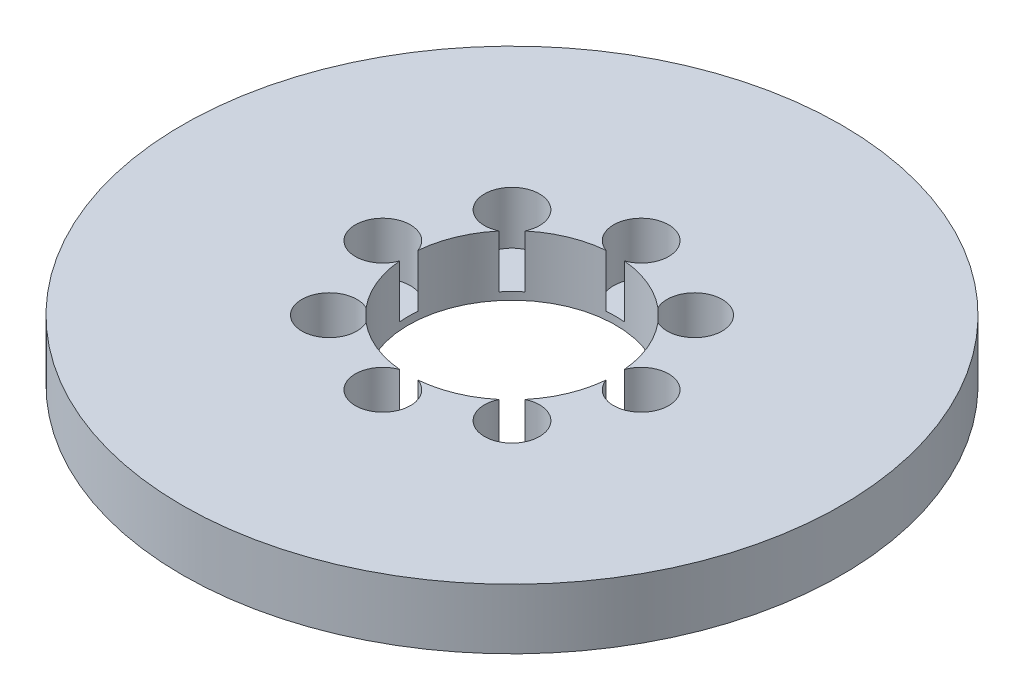
ISO-10303-21;
HEADER;
FILE_DESCRIPTION(('STEP AP214'),'2;1');
FILE_NAME('part.step','',(''),(''),'','','');
FILE_SCHEMA(('AUTOMOTIVE_DESIGN { 1 0 10303 214 1 1 1 1 }'));
ENDSEC;
DATA;
#1=APPLICATION_CONTEXT('core data for automotive mechanical design processes');
#2=APPLICATION_PROTOCOL_DEFINITION('international standard','automotive_design',2000,#1);
#3=PRODUCT_CONTEXT('',#1,'mechanical');
#4=PRODUCT('Part','Part','',(#3));
#5=PRODUCT_RELATED_PRODUCT_CATEGORY('part','',(#4));
#6=PRODUCT_DEFINITION_FORMATION('','',#4);
#7=PRODUCT_DEFINITION_CONTEXT('part definition',#1,'design');
#8=PRODUCT_DEFINITION('design','',#6,#7);
#9=PRODUCT_DEFINITION_SHAPE('','',#8);
#10=(LENGTH_UNIT() NAMED_UNIT(*) SI_UNIT(.MILLI.,.METRE.));
#11=(NAMED_UNIT(*) PLANE_ANGLE_UNIT() SI_UNIT($,.RADIAN.));
#12=(NAMED_UNIT(*) SI_UNIT($,.STERADIAN.) SOLID_ANGLE_UNIT());
#13=UNCERTAINTY_MEASURE_WITH_UNIT(LENGTH_MEASURE(1.E-05),#10,'distance_accuracy_value','');
#14=(GEOMETRIC_REPRESENTATION_CONTEXT(3) GLOBAL_UNCERTAINTY_ASSIGNED_CONTEXT((#13)) GLOBAL_UNIT_ASSIGNED_CONTEXT((#10,
#11,#12)) REPRESENTATION_CONTEXT('',''));
#15=CARTESIAN_POINT('',(0.,0.,0.));
#16=DIRECTION('',(0.,0.,1.));
#17=DIRECTION('',(1.,0.,0.));
#18=AXIS2_PLACEMENT_3D('',#15,#16,#17);
#19=CARTESIAN_POINT('',(0.,16.,0.));
#20=DIRECTION('',(0.,-1.,0.));
#21=DIRECTION('',(0.,0.,-1.));
#22=AXIS2_PLACEMENT_3D('',#19,#20,#21);
#23=CYLINDRICAL_SURFACE('',#22,87.5);
#24=CARTESIAN_POINT('',(0.,16.,0.));
#25=DIRECTION('',(0.,1.,0.));
#26=DIRECTION('',(0.,0.,1.));
#27=AXIS2_PLACEMENT_3D('',#24,#25,#26);
#28=CIRCLE('',#27,87.5);
#29=CARTESIAN_POINT('',(0.,16.,87.5));
#30=VERTEX_POINT('',#29);
#31=EDGE_CURVE('E195',#30,#30,#28,.T.);
#32=ORIENTED_EDGE('',*,*,#31,.F.);
#33=EDGE_LOOP('',(#32));
#34=FACE_BOUND('',#33,.T.);
#35=CARTESIAN_POINT('',(0.,0.,0.));
#36=DIRECTION('',(0.,1.,0.));
#37=DIRECTION('',(0.,0.,1.));
#38=AXIS2_PLACEMENT_3D('',#35,#36,#37);
#39=CIRCLE('',#38,87.5);
#40=CARTESIAN_POINT('',(0.,0.,87.5));
#41=VERTEX_POINT('',#40);
#42=EDGE_CURVE('E179',#41,#41,#39,.T.);
#43=ORIENTED_EDGE('',*,*,#42,.T.);
#44=EDGE_LOOP('',(#43));
#45=FACE_BOUND('',#44,.T.);
#46=ADVANCED_FACE('F39',(#34,#45),#23,.T.);
#47=CARTESIAN_POINT('',(0.,16.,0.));
#48=DIRECTION('',(0.,1.,0.));
#49=DIRECTION('',(0.,0.,1.));
#50=AXIS2_PLACEMENT_3D('',#47,#48,#49);
#51=PLANE('',#50);
#52=CARTESIAN_POINT('',(1.19720164488988E-13,16.,34.2892179193649));
#53=DIRECTION('',(0.,1.,0.));
#54=DIRECTION('',(1.,0.,0.));
#55=AXIS2_PLACEMENT_3D('',#52,#53,#54);
#56=CIRCLE('',#55,7.30778936502692);
#57=CARTESIAN_POINT('',(-2.41898986393209,16.,27.3934022720471));
#58=VERTEX_POINT('',#57);
#59=CARTESIAN_POINT('',(2.41898986393228,16.,27.3934022720471));
#60=VERTEX_POINT('',#59);
#61=EDGE_CURVE('E176',#58,#60,#56,.T.);
#62=ORIENTED_EDGE('',*,*,#61,.F.);
#63=CARTESIAN_POINT('',(0.,16.,0.));
#64=DIRECTION('',(0.,1.,0.));
#65=DIRECTION('',(0.,0.,1.));
#66=AXIS2_PLACEMENT_3D('',#63,#64,#65);
#67=CIRCLE('',#66,27.5);
#68=CARTESIAN_POINT('',(-17.6595763699275,16.,21.0805446427434));
#69=VERTEX_POINT('',#68);
#70=EDGE_CURVE('E166',#69,#58,#67,.T.);
#71=ORIENTED_EDGE('',*,*,#70,.F.);
#72=CARTESIAN_POINT('',(-24.2461385123662,16.,24.2461385123663));
#73=DIRECTION('',(0.,1.,0.));
#74=DIRECTION('',(0.707106781186549,0.,0.707106781186546));
#75=AXIS2_PLACEMENT_3D('',#72,#73,#74);
#76=CIRCLE('',#75,7.30778936502692);
#77=CARTESIAN_POINT('',(-21.0805446427434,16.,17.6595763699275));
#78=VERTEX_POINT('',#77);
#79=EDGE_CURVE('E147',#78,#69,#76,.T.);
#80=ORIENTED_EDGE('',*,*,#79,.F.);
#81=CARTESIAN_POINT('',(-27.3934022720471,16.,2.41898986393219));
#82=VERTEX_POINT('',#81);
#83=EDGE_CURVE('E180',#82,#78,#67,.T.);
#84=ORIENTED_EDGE('',*,*,#83,.F.);
#85=CARTESIAN_POINT('',(-34.2892179193649,16.,0.));
#86=DIRECTION('',(0.,1.,0.));
#87=DIRECTION('',(0.,0.,1.));
#88=AXIS2_PLACEMENT_3D('',#85,#86,#87);
#89=CIRCLE('',#88,7.30778936502692);
#90=CARTESIAN_POINT('',(-27.3934022720471,16.,-2.41898986393219));
#91=VERTEX_POINT('',#90);
#92=EDGE_CURVE('E186',#91,#82,#89,.T.);
#93=ORIENTED_EDGE('',*,*,#92,.F.);
#94=CARTESIAN_POINT('',(-21.0805446427436,16.,-17.6595763699272));
#95=VERTEX_POINT('',#94);
#96=EDGE_CURVE('E182',#95,#91,#67,.T.);
#97=ORIENTED_EDGE('',*,*,#96,.F.);
#98=CARTESIAN_POINT('',(-24.2461385123665,16.,-24.2461385123659));
#99=DIRECTION('',(0.,1.,0.));
#100=DIRECTION('',(-0.707106781186539,0.,0.707106781186556));
#101=AXIS2_PLACEMENT_3D('',#98,#99,#100);
#102=CIRCLE('',#101,7.30778936502692);
#103=CARTESIAN_POINT('',(-17.6595763699277,16.,-21.0805446427432));
#104=VERTEX_POINT('',#103);
#105=EDGE_CURVE('E446',#104,#95,#102,.T.);
#106=ORIENTED_EDGE('',*,*,#105,.F.);
#107=CARTESIAN_POINT('',(-2.41898986393247,16.,-27.393402272047));
#108=VERTEX_POINT('',#107);
#109=EDGE_CURVE('E452',#108,#104,#67,.T.);
#110=ORIENTED_EDGE('',*,*,#109,.F.);
#111=CARTESIAN_POINT('',(-3.59160493466965E-13,16.,-34.2892179193649));
#112=DIRECTION('',(0.,1.,0.));
#113=DIRECTION('',(-1.,0.,0.));
#114=AXIS2_PLACEMENT_3D('',#111,#112,#113);
#115=CIRCLE('',#114,7.30778936502692);
#116=CARTESIAN_POINT('',(2.4189898639319,16.,-27.3934022720471));
#117=VERTEX_POINT('',#116);
#118=EDGE_CURVE('E477',#117,#108,#115,.T.);
#119=ORIENTED_EDGE('',*,*,#118,.F.);
#120=CARTESIAN_POINT('',(17.6595763699273,16.,-21.0805446427436));
#121=VERTEX_POINT('',#120);
#122=EDGE_CURVE('E460',#121,#117,#67,.T.);
#123=ORIENTED_EDGE('',*,*,#122,.F.);
#124=CARTESIAN_POINT('',(24.246138512366,16.,-24.2461385123664));
#125=DIRECTION('',(0.,1.,0.));
#126=DIRECTION('',(-0.707106781186554,0.,-0.707106781186541));
#127=AXIS2_PLACEMENT_3D('',#124,#125,#126);
#128=CIRCLE('',#127,7.30778936502692);
#129=CARTESIAN_POINT('',(21.0805446427433,16.,-17.6595763699277));
#130=VERTEX_POINT('',#129);
#131=EDGE_CURVE('E464',#130,#121,#128,.T.);
#132=ORIENTED_EDGE('',*,*,#131,.F.);
#133=CARTESIAN_POINT('',(27.3934022720471,16.,-2.41898986393219));
#134=VERTEX_POINT('',#133);
#135=EDGE_CURVE('E459',#134,#130,#67,.T.);
#136=ORIENTED_EDGE('',*,*,#135,.F.);
#137=CARTESIAN_POINT('',(34.2892179193649,16.,0.));
#138=DIRECTION('',(0.,1.,0.));
#139=DIRECTION('',(0.,0.,-1.));
#140=AXIS2_PLACEMENT_3D('',#137,#138,#139);
#141=CIRCLE('',#140,7.30778936502692);
#142=CARTESIAN_POINT('',(27.3934022720471,16.,2.41898986393219));
#143=VERTEX_POINT('',#142);
#144=EDGE_CURVE('E469',#143,#134,#141,.T.);
#145=ORIENTED_EDGE('',*,*,#144,.F.);
#146=CARTESIAN_POINT('',(21.0805446427435,16.,17.6595763699274));
#147=VERTEX_POINT('',#146);
#148=EDGE_CURVE('E181',#147,#143,#67,.T.);
#149=ORIENTED_EDGE('',*,*,#148,.F.);
#150=CARTESIAN_POINT('',(24.2461385123663,16.,24.2461385123661));
#151=DIRECTION('',(0.,1.,0.));
#152=DIRECTION('',(0.707106781186544,0.,-0.707106781186551));
#153=AXIS2_PLACEMENT_3D('',#150,#151,#152);
#154=CIRCLE('',#153,7.30778936502692);
#155=CARTESIAN_POINT('',(17.6595763699276,16.,21.0805446427433));
#156=VERTEX_POINT('',#155);
#157=EDGE_CURVE('E475',#156,#147,#154,.T.);
#158=ORIENTED_EDGE('',*,*,#157,.F.);
#159=EDGE_CURVE('E177',#60,#156,#67,.T.);
#160=ORIENTED_EDGE('',*,*,#159,.F.);
#161=EDGE_LOOP('',(#62,#71,#80,#84,#93,#97,#106,#110,#119,#123,#132,#136,#145,#149,#158,#160));
#162=FACE_BOUND('',#161,.T.);
#163=ORIENTED_EDGE('',*,*,#31,.T.);
#164=EDGE_LOOP('',(#163));
#165=FACE_BOUND('',#164,.T.);
#166=ADVANCED_FACE('F172',(#162,#165),#51,.T.);
#167=CARTESIAN_POINT('',(0.,0.,0.));
#168=DIRECTION('',(0.,1.,0.));
#169=DIRECTION('',(0.,0.,1.));
#170=AXIS2_PLACEMENT_3D('',#167,#168,#169);
#171=PLANE('',#170);
#172=CARTESIAN_POINT('',(0.,0.,0.));
#173=DIRECTION('',(0.,1.,0.));
#174=DIRECTION('',(0.,0.,1.));
#175=AXIS2_PLACEMENT_3D('',#172,#173,#174);
#176=CIRCLE('',#175,27.5);
#177=CARTESIAN_POINT('',(0.,0.,27.5));
#178=VERTEX_POINT('',#177);
#179=EDGE_CURVE('E187',#178,#178,#176,.T.);
#180=ORIENTED_EDGE('',*,*,#179,.T.);
#181=EDGE_LOOP('',(#180));
#182=FACE_BOUND('',#181,.T.);
#183=ORIENTED_EDGE('',*,*,#42,.F.);
#184=EDGE_LOOP('',(#183));
#185=FACE_BOUND('',#184,.T.);
#186=ADVANCED_FACE('F270',(#182,#185),#171,.F.);
#187=CARTESIAN_POINT('',(0.,16.,0.));
#188=DIRECTION('',(0.,-1.,0.));
#189=DIRECTION('',(0.,0.,-1.));
#190=AXIS2_PLACEMENT_3D('',#187,#188,#189);
#191=CYLINDRICAL_SURFACE('',#190,27.5);
#192=DIRECTION('',(0.,1.,0.));
#193=VECTOR('',#192,1.);
#194=CARTESIAN_POINT('',(-2.41898986393212,9.00288491368027,27.3934022720471));
#195=LINE('',#194,#193);
#196=CARTESIAN_POINT('',(-2.41898986393209,2.00576982736055,27.3934022720471));
#197=VERTEX_POINT('',#196);
#198=EDGE_CURVE('E11',#197,#58,#195,.T.);
#199=ORIENTED_EDGE('',*,*,#198,.F.);
#200=CARTESIAN_POINT('',(0.,2.00576982736055,0.));
#201=DIRECTION('',(0.,1.,0.));
#202=DIRECTION('',(0.,0.,1.));
#203=AXIS2_PLACEMENT_3D('',#200,#201,#202);
#204=CIRCLE('',#203,27.5);
#205=CARTESIAN_POINT('',(2.41898986393228,2.00576982736055,27.3934022720471));
#206=VERTEX_POINT('',#205);
#207=EDGE_CURVE('E250',#197,#206,#204,.T.);
#208=ORIENTED_EDGE('',*,*,#207,.T.);
#209=DIRECTION('',(0.,1.,0.));
#210=VECTOR('',#209,1.);
#211=CARTESIAN_POINT('',(2.41898986393231,9.00288491368027,27.3934022720471));
#212=LINE('',#211,#210);
#213=EDGE_CURVE('E46',#60,#206,#212,.F.);
#214=ORIENTED_EDGE('',*,*,#213,.F.);
#215=ORIENTED_EDGE('',*,*,#159,.T.);
#216=DIRECTION('',(0.,1.,0.));
#217=VECTOR('',#216,1.);
#218=CARTESIAN_POINT('',(17.6595763699276,9.00288491368027,21.0805446427434));
#219=LINE('',#218,#217);
#220=CARTESIAN_POINT('',(17.6595763699276,2.00576982736055,21.0805446427433));
#221=VERTEX_POINT('',#220);
#222=EDGE_CURVE('E244',#221,#156,#219,.T.);
#223=ORIENTED_EDGE('',*,*,#222,.F.);
#224=CARTESIAN_POINT('',(0.,2.00576982736055,0.));
#225=DIRECTION('',(0.,1.,0.));
#226=DIRECTION('',(0.,0.,1.));
#227=AXIS2_PLACEMENT_3D('',#224,#225,#226);
#228=CIRCLE('',#227,27.5);
#229=CARTESIAN_POINT('',(21.0805446427435,2.00576982736055,17.6595763699274));
#230=VERTEX_POINT('',#229);
#231=EDGE_CURVE('E238',#221,#230,#228,.T.);
#232=ORIENTED_EDGE('',*,*,#231,.T.);
#233=DIRECTION('',(0.,1.,0.));
#234=VECTOR('',#233,1.);
#235=CARTESIAN_POINT('',(21.0805446427436,9.00288491368027,17.6595763699274));
#236=LINE('',#235,#234);
#237=EDGE_CURVE('E242',#147,#230,#236,.F.);
#238=ORIENTED_EDGE('',*,*,#237,.F.);
#239=ORIENTED_EDGE('',*,*,#148,.T.);
#240=DIRECTION('',(0.,1.,0.));
#241=VECTOR('',#240,1.);
#242=CARTESIAN_POINT('',(27.3934022720471,9.00288491368027,2.41898986393221));
#243=LINE('',#242,#241);
#244=CARTESIAN_POINT('',(27.3934022720471,2.00576982736055,2.41898986393219));
#245=VERTEX_POINT('',#244);
#246=EDGE_CURVE('E236',#245,#143,#243,.T.);
#247=ORIENTED_EDGE('',*,*,#246,.F.);
#248=CARTESIAN_POINT('',(0.,2.00576982736055,0.));
#249=DIRECTION('',(0.,1.,0.));
#250=DIRECTION('',(0.,0.,1.));
#251=AXIS2_PLACEMENT_3D('',#248,#249,#250);
#252=CIRCLE('',#251,27.5);
#253=CARTESIAN_POINT('',(27.3934022720471,2.00576982736055,-2.41898986393219));
#254=VERTEX_POINT('',#253);
#255=EDGE_CURVE('E235',#245,#254,#252,.T.);
#256=ORIENTED_EDGE('',*,*,#255,.T.);
#257=DIRECTION('',(0.,1.,0.));
#258=VECTOR('',#257,1.);
#259=CARTESIAN_POINT('',(27.3934022720471,9.00288491368027,-2.41898986393221));
#260=LINE('',#259,#258);
#261=EDGE_CURVE('E234',#134,#254,#260,.F.);
#262=ORIENTED_EDGE('',*,*,#261,.F.);
#263=ORIENTED_EDGE('',*,*,#135,.T.);
#264=DIRECTION('',(0.,1.,0.));
#265=VECTOR('',#264,1.);
#266=CARTESIAN_POINT('',(21.0805446427433,9.00288491368027,-17.6595763699277));
#267=LINE('',#266,#265);
#268=CARTESIAN_POINT('',(21.0805446427433,2.00576982736055,-17.6595763699277));
#269=VERTEX_POINT('',#268);
#270=EDGE_CURVE('E229',#269,#130,#267,.T.);
#271=ORIENTED_EDGE('',*,*,#270,.F.);
#272=CARTESIAN_POINT('',(0.,2.00576982736055,0.));
#273=DIRECTION('',(0.,1.,0.));
#274=DIRECTION('',(0.,0.,1.));
#275=AXIS2_PLACEMENT_3D('',#272,#273,#274);
#276=CIRCLE('',#275,27.5);
#277=CARTESIAN_POINT('',(17.6595763699273,2.00576982736055,-21.0805446427436));
#278=VERTEX_POINT('',#277);
#279=EDGE_CURVE('E221',#269,#278,#276,.T.);
#280=ORIENTED_EDGE('',*,*,#279,.T.);
#281=DIRECTION('',(0.,1.,0.));
#282=VECTOR('',#281,1.);
#283=CARTESIAN_POINT('',(17.6595763699273,9.00288491368027,-21.0805446427436));
#284=LINE('',#283,#282);
#285=EDGE_CURVE('E230',#121,#278,#284,.F.);
#286=ORIENTED_EDGE('',*,*,#285,.F.);
#287=ORIENTED_EDGE('',*,*,#122,.T.);
#288=DIRECTION('',(0.,1.,0.));
#289=VECTOR('',#288,1.);
#290=CARTESIAN_POINT('',(2.41898986393192,9.00288491368027,-27.3934022720471));
#291=LINE('',#290,#289);
#292=CARTESIAN_POINT('',(2.4189898639319,2.00576982736055,-27.3934022720471));
#293=VERTEX_POINT('',#292);
#294=EDGE_CURVE('E225',#293,#117,#291,.T.);
#295=ORIENTED_EDGE('',*,*,#294,.F.);
#296=CARTESIAN_POINT('',(0.,2.00576982736055,0.));
#297=DIRECTION('',(0.,1.,0.));
#298=DIRECTION('',(0.,0.,1.));
#299=AXIS2_PLACEMENT_3D('',#296,#297,#298);
#300=CIRCLE('',#299,27.5);
#301=CARTESIAN_POINT('',(-2.41898986393247,2.00576982736055,-27.393402272047));
#302=VERTEX_POINT('',#301);
#303=EDGE_CURVE('E216',#293,#302,#300,.T.);
#304=ORIENTED_EDGE('',*,*,#303,.T.);
#305=DIRECTION('',(0.,1.,0.));
#306=VECTOR('',#305,1.);
#307=CARTESIAN_POINT('',(-2.4189898639325,9.00288491368027,-27.393402272047));
#308=LINE('',#307,#306);
#309=EDGE_CURVE('E218',#108,#302,#308,.F.);
#310=ORIENTED_EDGE('',*,*,#309,.F.);
#311=ORIENTED_EDGE('',*,*,#109,.T.);
#312=DIRECTION('',(0.,1.,0.));
#313=VECTOR('',#312,1.);
#314=CARTESIAN_POINT('',(-17.6595763699277,9.00288491368027,-21.0805446427432));
#315=LINE('',#314,#313);
#316=CARTESIAN_POINT('',(-17.6595763699277,2.00576982736055,-21.0805446427432));
#317=VERTEX_POINT('',#316);
#318=EDGE_CURVE('E212',#317,#104,#315,.T.);
#319=ORIENTED_EDGE('',*,*,#318,.F.);
#320=CARTESIAN_POINT('',(0.,2.00576982736055,0.));
#321=DIRECTION('',(0.,1.,0.));
#322=DIRECTION('',(0.,0.,1.));
#323=AXIS2_PLACEMENT_3D('',#320,#321,#322);
#324=CIRCLE('',#323,27.5);
#325=CARTESIAN_POINT('',(-21.0805446427436,2.00576982736055,-17.6595763699272));
#326=VERTEX_POINT('',#325);
#327=EDGE_CURVE('E208',#317,#326,#324,.T.);
#328=ORIENTED_EDGE('',*,*,#327,.T.);
#329=DIRECTION('',(0.,1.,0.));
#330=VECTOR('',#329,1.);
#331=CARTESIAN_POINT('',(-21.0805446427437,9.00288491368027,-17.6595763699272));
#332=LINE('',#331,#330);
#333=EDGE_CURVE('E211',#95,#326,#332,.F.);
#334=ORIENTED_EDGE('',*,*,#333,.F.);
#335=ORIENTED_EDGE('',*,*,#96,.T.);
#336=DIRECTION('',(0.,1.,0.));
#337=VECTOR('',#336,1.);
#338=CARTESIAN_POINT('',(-27.3934022720471,9.00288491368027,-2.41898986393221));
#339=LINE('',#338,#337);
#340=CARTESIAN_POINT('',(-27.3934022720471,2.00576982736055,-2.41898986393219));
#341=VERTEX_POINT('',#340);
#342=EDGE_CURVE('E201',#341,#91,#339,.T.);
#343=ORIENTED_EDGE('',*,*,#342,.F.);
#344=CARTESIAN_POINT('',(0.,2.00576982736055,0.));
#345=DIRECTION('',(0.,1.,0.));
#346=DIRECTION('',(0.,0.,1.));
#347=AXIS2_PLACEMENT_3D('',#344,#345,#346);
#348=CIRCLE('',#347,27.5);
#349=CARTESIAN_POINT('',(-27.3934022720471,2.00576982736055,2.41898986393219));
#350=VERTEX_POINT('',#349);
#351=EDGE_CURVE('E194',#341,#350,#348,.T.);
#352=ORIENTED_EDGE('',*,*,#351,.T.);
#353=DIRECTION('',(0.,1.,0.));
#354=VECTOR('',#353,1.);
#355=CARTESIAN_POINT('',(-27.3934022720471,9.00288491368027,2.41898986393221));
#356=LINE('',#355,#354);
#357=EDGE_CURVE('E199',#82,#350,#356,.F.);
#358=ORIENTED_EDGE('',*,*,#357,.F.);
#359=ORIENTED_EDGE('',*,*,#83,.T.);
#360=DIRECTION('',(0.,1.,0.));
#361=VECTOR('',#360,1.);
#362=CARTESIAN_POINT('',(-21.0805446427434,9.00288491368027,17.6595763699275));
#363=LINE('',#362,#361);
#364=CARTESIAN_POINT('',(-21.0805446427434,2.00576982736055,17.6595763699275));
#365=VERTEX_POINT('',#364);
#366=EDGE_CURVE('E160',#365,#78,#363,.T.);
#367=ORIENTED_EDGE('',*,*,#366,.F.);
#368=CARTESIAN_POINT('',(0.,2.00576982736055,0.));
#369=DIRECTION('',(0.,1.,0.));
#370=DIRECTION('',(0.,0.,1.));
#371=AXIS2_PLACEMENT_3D('',#368,#369,#370);
#372=CIRCLE('',#371,27.5);
#373=CARTESIAN_POINT('',(-17.6595763699275,2.00576982736055,21.0805446427434));
#374=VERTEX_POINT('',#373);
#375=EDGE_CURVE('E168',#365,#374,#372,.T.);
#376=ORIENTED_EDGE('',*,*,#375,.T.);
#377=DIRECTION('',(0.,1.,0.));
#378=VECTOR('',#377,1.);
#379=CARTESIAN_POINT('',(-17.6595763699275,9.00288491368027,21.0805446427434));
#380=LINE('',#379,#378);
#381=EDGE_CURVE('E152',#69,#374,#380,.F.);
#382=ORIENTED_EDGE('',*,*,#381,.F.);
#383=ORIENTED_EDGE('',*,*,#70,.T.);
#384=EDGE_LOOP('',(#199,#208,#214,#215,#223,#232,#238,#239,#247,#256,#262,#263,#271,#280,#286,
#287,#295,#304,#310,#311,#319,#328,#334,#335,#343,#352,#358,#359,#367,#376,#382,#383));
#385=FACE_BOUND('',#384,.T.);
#386=ORIENTED_EDGE('',*,*,#179,.F.);
#387=EDGE_LOOP('',(#386));
#388=FACE_BOUND('',#387,.T.);
#389=ADVANCED_FACE('F170',(#385,#388),#191,.F.);
#390=CARTESIAN_POINT('',(-34.2892179193649,2.00576982736055,0.));
#391=DIRECTION('',(0.,1.,0.));
#392=DIRECTION('',(0.,0.,1.));
#393=AXIS2_PLACEMENT_3D('',#390,#391,#392);
#394=CYLINDRICAL_SURFACE('',#393,7.30778936502692);
#395=ORIENTED_EDGE('',*,*,#342,.T.);
#396=ORIENTED_EDGE('',*,*,#92,.T.);
#397=ORIENTED_EDGE('',*,*,#357,.T.);
#398=CARTESIAN_POINT('',(-34.2892179193649,2.00576982736055,0.));
#399=DIRECTION('',(0.,1.,0.));
#400=DIRECTION('',(0.,0.,1.));
#401=AXIS2_PLACEMENT_3D('',#398,#399,#400);
#402=CIRCLE('',#401,7.30778936502692);
#403=EDGE_CURVE('E191',#341,#350,#402,.T.);
#404=ORIENTED_EDGE('',*,*,#403,.F.);
#405=EDGE_LOOP('',(#395,#396,#397,#404));
#406=FACE_BOUND('',#405,.T.);
#407=ADVANCED_FACE('F279',(#406),#394,.F.);
#408=CARTESIAN_POINT('',(-34.2892179193649,2.00576982736055,0.));
#409=DIRECTION('',(0.,1.,0.));
#410=DIRECTION('',(0.,0.,1.));
#411=AXIS2_PLACEMENT_3D('',#408,#409,#410);
#412=PLANE('',#411);
#413=ORIENTED_EDGE('',*,*,#403,.T.);
#414=ORIENTED_EDGE('',*,*,#351,.F.);
#415=EDGE_LOOP('',(#413,#414));
#416=FACE_BOUND('',#415,.T.);
#417=ADVANCED_FACE('F285',(#416),#412,.T.);
#418=CARTESIAN_POINT('',(-24.2461385123662,2.00576982736055,24.2461385123663));
#419=DIRECTION('',(0.,1.,0.));
#420=DIRECTION('',(0.,0.,1.));
#421=AXIS2_PLACEMENT_3D('',#418,#419,#420);
#422=CYLINDRICAL_SURFACE('',#421,7.30778936502692);
#423=ORIENTED_EDGE('',*,*,#366,.T.);
#424=ORIENTED_EDGE('',*,*,#79,.T.);
#425=ORIENTED_EDGE('',*,*,#381,.T.);
#426=CARTESIAN_POINT('',(-24.2461385123662,2.00576982736055,24.2461385123663));
#427=DIRECTION('',(0.,1.,0.));
#428=DIRECTION('',(0.707106781186549,0.,0.707106781186546));
#429=AXIS2_PLACEMENT_3D('',#426,#427,#428);
#430=CIRCLE('',#429,7.30778936502692);
#431=EDGE_CURVE('E165',#365,#374,#430,.T.);
#432=ORIENTED_EDGE('',*,*,#431,.F.);
#433=EDGE_LOOP('',(#423,#424,#425,#432));
#434=FACE_BOUND('',#433,.T.);
#435=ADVANCED_FACE('F155',(#434),#422,.F.);
#436=CARTESIAN_POINT('',(-24.2461385123662,2.00576982736055,24.2461385123663));
#437=DIRECTION('',(0.,1.,0.));
#438=DIRECTION('',(0.707106781186549,0.,0.707106781186546));
#439=AXIS2_PLACEMENT_3D('',#436,#437,#438);
#440=PLANE('',#439);
#441=ORIENTED_EDGE('',*,*,#431,.T.);
#442=ORIENTED_EDGE('',*,*,#375,.F.);
#443=EDGE_LOOP('',(#441,#442));
#444=FACE_BOUND('',#443,.T.);
#445=ADVANCED_FACE('F288',(#444),#440,.T.);
#446=CARTESIAN_POINT('',(-24.2461385123665,2.00576982736055,-24.2461385123659));
#447=DIRECTION('',(0.,1.,0.));
#448=DIRECTION('',(0.,0.,1.));
#449=AXIS2_PLACEMENT_3D('',#446,#447,#448);
#450=CYLINDRICAL_SURFACE('',#449,7.30778936502692);
#451=ORIENTED_EDGE('',*,*,#318,.T.);
#452=ORIENTED_EDGE('',*,*,#105,.T.);
#453=ORIENTED_EDGE('',*,*,#333,.T.);
#454=CARTESIAN_POINT('',(-24.2461385123665,2.00576982736055,-24.2461385123659));
#455=DIRECTION('',(0.,1.,0.));
#456=DIRECTION('',(-0.707106781186539,0.,0.707106781186556));
#457=AXIS2_PLACEMENT_3D('',#454,#455,#456);
#458=CIRCLE('',#457,7.30778936502692);
#459=EDGE_CURVE('E447',#317,#326,#458,.T.);
#460=ORIENTED_EDGE('',*,*,#459,.F.);
#461=EDGE_LOOP('',(#451,#452,#453,#460));
#462=FACE_BOUND('',#461,.T.);
#463=ADVANCED_FACE('F295',(#462),#450,.F.);
#464=CARTESIAN_POINT('',(-24.2461385123665,2.00576982736055,-24.2461385123659));
#465=DIRECTION('',(0.,1.,0.));
#466=DIRECTION('',(-0.707106781186539,0.,0.707106781186556));
#467=AXIS2_PLACEMENT_3D('',#464,#465,#466);
#468=PLANE('',#467);
#469=ORIENTED_EDGE('',*,*,#459,.T.);
#470=ORIENTED_EDGE('',*,*,#327,.F.);
#471=EDGE_LOOP('',(#469,#470));
#472=FACE_BOUND('',#471,.T.);
#473=ADVANCED_FACE('F375',(#472),#468,.T.);
#474=CARTESIAN_POINT('',(-3.59160493466965E-13,2.00576982736055,-34.2892179193649));
#475=DIRECTION('',(0.,1.,0.));
#476=DIRECTION('',(0.,0.,1.));
#477=AXIS2_PLACEMENT_3D('',#474,#475,#476);
#478=CYLINDRICAL_SURFACE('',#477,7.30778936502692);
#479=ORIENTED_EDGE('',*,*,#294,.T.);
#480=ORIENTED_EDGE('',*,*,#118,.T.);
#481=ORIENTED_EDGE('',*,*,#309,.T.);
#482=CARTESIAN_POINT('',(-3.59160493466965E-13,2.00576982736055,-34.2892179193649));
#483=DIRECTION('',(0.,1.,0.));
#484=DIRECTION('',(-1.,0.,0.));
#485=AXIS2_PLACEMENT_3D('',#482,#483,#484);
#486=CIRCLE('',#485,7.30778936502692);
#487=EDGE_CURVE('E467',#293,#302,#486,.T.);
#488=ORIENTED_EDGE('',*,*,#487,.F.);
#489=EDGE_LOOP('',(#479,#480,#481,#488));
#490=FACE_BOUND('',#489,.T.);
#491=ADVANCED_FACE('F361',(#490),#478,.F.);
#492=CARTESIAN_POINT('',(-3.59160493466965E-13,2.00576982736055,-34.2892179193649));
#493=DIRECTION('',(0.,1.,0.));
#494=DIRECTION('',(-1.,0.,0.));
#495=AXIS2_PLACEMENT_3D('',#492,#493,#494);
#496=PLANE('',#495);
#497=ORIENTED_EDGE('',*,*,#487,.T.);
#498=ORIENTED_EDGE('',*,*,#303,.F.);
#499=EDGE_LOOP('',(#497,#498));
#500=FACE_BOUND('',#499,.T.);
#501=ADVANCED_FACE('F297',(#500),#496,.T.);
#502=CARTESIAN_POINT('',(24.246138512366,2.00576982736055,-24.2461385123664));
#503=DIRECTION('',(0.,1.,0.));
#504=DIRECTION('',(0.,0.,1.));
#505=AXIS2_PLACEMENT_3D('',#502,#503,#504);
#506=CYLINDRICAL_SURFACE('',#505,7.30778936502692);
#507=ORIENTED_EDGE('',*,*,#270,.T.);
#508=ORIENTED_EDGE('',*,*,#131,.T.);
#509=ORIENTED_EDGE('',*,*,#285,.T.);
#510=CARTESIAN_POINT('',(24.246138512366,2.00576982736055,-24.2461385123664));
#511=DIRECTION('',(0.,1.,0.));
#512=DIRECTION('',(-0.707106781186554,0.,-0.707106781186541));
#513=AXIS2_PLACEMENT_3D('',#510,#511,#512);
#514=CIRCLE('',#513,7.30778936502692);
#515=EDGE_CURVE('E470',#269,#278,#514,.T.);
#516=ORIENTED_EDGE('',*,*,#515,.F.);
#517=EDGE_LOOP('',(#507,#508,#509,#516));
#518=FACE_BOUND('',#517,.T.);
#519=ADVANCED_FACE('F294',(#518),#506,.F.);
#520=CARTESIAN_POINT('',(24.246138512366,2.00576982736055,-24.2461385123664));
#521=DIRECTION('',(0.,1.,0.));
#522=DIRECTION('',(-0.707106781186554,0.,-0.707106781186541));
#523=AXIS2_PLACEMENT_3D('',#520,#521,#522);
#524=PLANE('',#523);
#525=ORIENTED_EDGE('',*,*,#515,.T.);
#526=ORIENTED_EDGE('',*,*,#279,.F.);
#527=EDGE_LOOP('',(#525,#526));
#528=FACE_BOUND('',#527,.T.);
#529=ADVANCED_FACE('F300',(#528),#524,.T.);
#530=CARTESIAN_POINT('',(34.2892179193649,2.00576982736055,0.));
#531=DIRECTION('',(0.,1.,0.));
#532=DIRECTION('',(0.,0.,1.));
#533=AXIS2_PLACEMENT_3D('',#530,#531,#532);
#534=CYLINDRICAL_SURFACE('',#533,7.30778936502692);
#535=ORIENTED_EDGE('',*,*,#246,.T.);
#536=ORIENTED_EDGE('',*,*,#144,.T.);
#537=ORIENTED_EDGE('',*,*,#261,.T.);
#538=CARTESIAN_POINT('',(34.2892179193649,2.00576982736055,0.));
#539=DIRECTION('',(0.,1.,0.));
#540=DIRECTION('',(0.,0.,-1.));
#541=AXIS2_PLACEMENT_3D('',#538,#539,#540);
#542=CIRCLE('',#541,7.30778936502692);
#543=EDGE_CURVE('E472',#245,#254,#542,.T.);
#544=ORIENTED_EDGE('',*,*,#543,.F.);
#545=EDGE_LOOP('',(#535,#536,#537,#544));
#546=FACE_BOUND('',#545,.T.);
#547=ADVANCED_FACE('F305',(#546),#534,.F.);
#548=CARTESIAN_POINT('',(34.2892179193649,2.00576982736055,0.));
#549=DIRECTION('',(0.,1.,0.));
#550=DIRECTION('',(0.,0.,-1.));
#551=AXIS2_PLACEMENT_3D('',#548,#549,#550);
#552=PLANE('',#551);
#553=ORIENTED_EDGE('',*,*,#543,.T.);
#554=ORIENTED_EDGE('',*,*,#255,.F.);
#555=EDGE_LOOP('',(#553,#554));
#556=FACE_BOUND('',#555,.T.);
#557=ADVANCED_FACE('F308',(#556),#552,.T.);
#558=CARTESIAN_POINT('',(24.2461385123663,2.00576982736055,24.2461385123661));
#559=DIRECTION('',(0.,1.,0.));
#560=DIRECTION('',(0.,0.,1.));
#561=AXIS2_PLACEMENT_3D('',#558,#559,#560);
#562=CYLINDRICAL_SURFACE('',#561,7.30778936502692);
#563=ORIENTED_EDGE('',*,*,#222,.T.);
#564=ORIENTED_EDGE('',*,*,#157,.T.);
#565=ORIENTED_EDGE('',*,*,#237,.T.);
#566=CARTESIAN_POINT('',(24.2461385123663,2.00576982736055,24.2461385123661));
#567=DIRECTION('',(0.,1.,0.));
#568=DIRECTION('',(0.707106781186544,0.,-0.707106781186551));
#569=AXIS2_PLACEMENT_3D('',#566,#567,#568);
#570=CIRCLE('',#569,7.30778936502692);
#571=EDGE_CURVE('E56',#221,#230,#570,.T.);
#572=ORIENTED_EDGE('',*,*,#571,.F.);
#573=EDGE_LOOP('',(#563,#564,#565,#572));
#574=FACE_BOUND('',#573,.T.);
#575=ADVANCED_FACE('F309',(#574),#562,.F.);
#576=CARTESIAN_POINT('',(24.2461385123663,2.00576982736055,24.2461385123661));
#577=DIRECTION('',(0.,1.,0.));
#578=DIRECTION('',(0.707106781186544,0.,-0.707106781186551));
#579=AXIS2_PLACEMENT_3D('',#576,#577,#578);
#580=PLANE('',#579);
#581=ORIENTED_EDGE('',*,*,#571,.T.);
#582=ORIENTED_EDGE('',*,*,#231,.F.);
#583=EDGE_LOOP('',(#581,#582));
#584=FACE_BOUND('',#583,.T.);
#585=ADVANCED_FACE('F256',(#584),#580,.T.);
#586=CARTESIAN_POINT('',(1.19720164488988E-13,2.00576982736055,34.2892179193649));
#587=DIRECTION('',(0.,1.,0.));
#588=DIRECTION('',(0.,0.,1.));
#589=AXIS2_PLACEMENT_3D('',#586,#587,#588);
#590=CYLINDRICAL_SURFACE('',#589,7.30778936502692);
#591=ORIENTED_EDGE('',*,*,#198,.T.);
#592=ORIENTED_EDGE('',*,*,#61,.T.);
#593=ORIENTED_EDGE('',*,*,#213,.T.);
#594=CARTESIAN_POINT('',(1.19720164488988E-13,2.00576982736055,34.2892179193649));
#595=DIRECTION('',(0.,1.,0.));
#596=DIRECTION('',(1.,0.,0.));
#597=AXIS2_PLACEMENT_3D('',#594,#595,#596);
#598=CIRCLE('',#597,7.30778936502692);
#599=EDGE_CURVE('E55',#197,#206,#598,.T.);
#600=ORIENTED_EDGE('',*,*,#599,.F.);
#601=EDGE_LOOP('',(#591,#592,#593,#600));
#602=FACE_BOUND('',#601,.T.);
#603=ADVANCED_FACE('F253',(#602),#590,.F.);
#604=CARTESIAN_POINT('',(1.19720164488988E-13,2.00576982736055,34.2892179193649));
#605=DIRECTION('',(0.,1.,0.));
#606=DIRECTION('',(1.,0.,0.));
#607=AXIS2_PLACEMENT_3D('',#604,#605,#606);
#608=PLANE('',#607);
#609=ORIENTED_EDGE('',*,*,#599,.T.);
#610=ORIENTED_EDGE('',*,*,#207,.F.);
#611=EDGE_LOOP('',(#609,#610));
#612=FACE_BOUND('',#611,.T.);
#613=ADVANCED_FACE('F252',(#612),#608,.T.);
#614=CLOSED_SHELL('',(#46,#166,#186,#389,#407,#417,#435,#445,#463,#473,#491,#501,#519,#529,#547,
#557,#575,#585,#603,#613));
#615=MANIFOLD_SOLID_BREP('B2',#614);
#616=ADVANCED_BREP_SHAPE_REPRESENTATION('',(#18,#615),#14);
#617=SHAPE_DEFINITION_REPRESENTATION(#9,#616);
ENDSEC;
END-ISO-10303-21;
